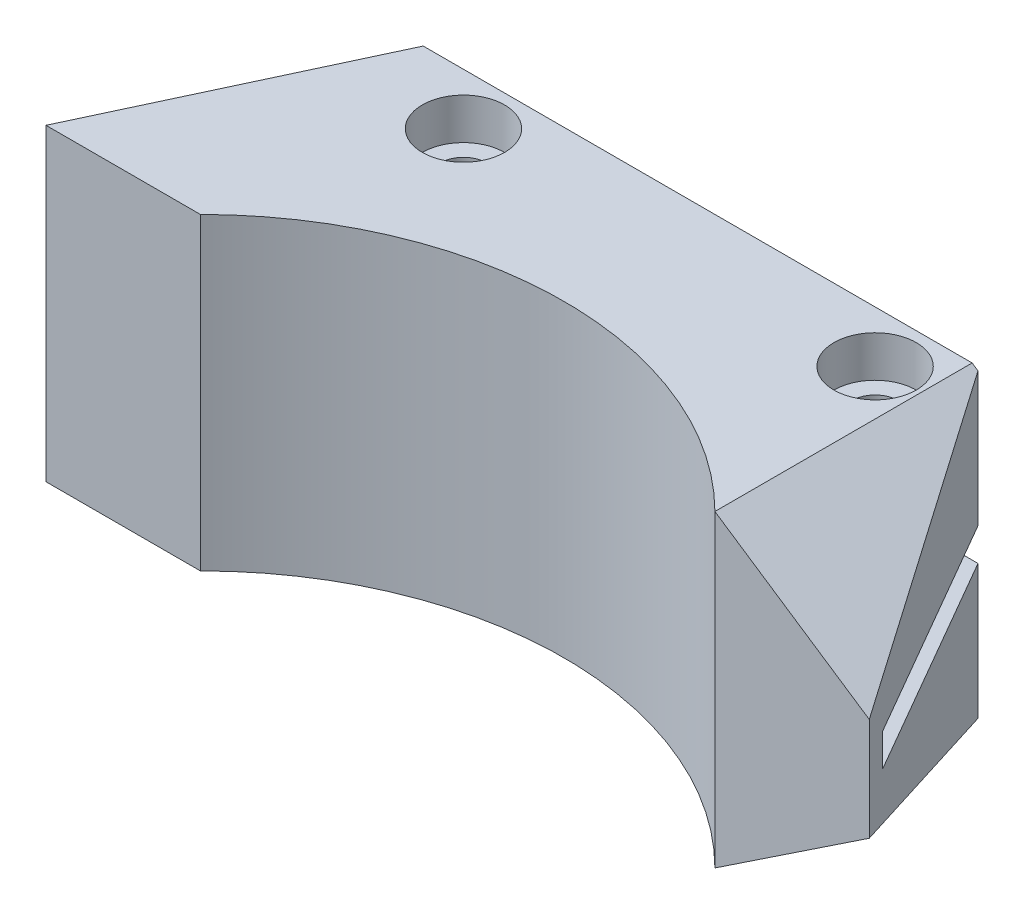
ISO-10303-21;
HEADER;
FILE_DESCRIPTION(('STEP AP214'),'2;1');
FILE_NAME('part.step','',(''),(''),'','','');
FILE_SCHEMA(('AUTOMOTIVE_DESIGN { 1 0 10303 214 1 1 1 1 }'));
ENDSEC;
DATA;
#1=APPLICATION_CONTEXT('core data for automotive mechanical design processes');
#2=APPLICATION_PROTOCOL_DEFINITION('international standard','automotive_design',2000,#1);
#3=PRODUCT_CONTEXT('',#1,'mechanical');
#4=PRODUCT('Part','Part','',(#3));
#5=PRODUCT_RELATED_PRODUCT_CATEGORY('part','',(#4));
#6=PRODUCT_DEFINITION_FORMATION('','',#4);
#7=PRODUCT_DEFINITION_CONTEXT('part definition',#1,'design');
#8=PRODUCT_DEFINITION('design','',#6,#7);
#9=PRODUCT_DEFINITION_SHAPE('','',#8);
#10=(LENGTH_UNIT() NAMED_UNIT(*) SI_UNIT(.MILLI.,.METRE.));
#11=(NAMED_UNIT(*) PLANE_ANGLE_UNIT() SI_UNIT($,.RADIAN.));
#12=(NAMED_UNIT(*) SI_UNIT($,.STERADIAN.) SOLID_ANGLE_UNIT());
#13=UNCERTAINTY_MEASURE_WITH_UNIT(LENGTH_MEASURE(1.E-05),#10,'distance_accuracy_value','');
#14=(GEOMETRIC_REPRESENTATION_CONTEXT(3) GLOBAL_UNCERTAINTY_ASSIGNED_CONTEXT((#13)) GLOBAL_UNIT_ASSIGNED_CONTEXT((#10,
#11,#12)) REPRESENTATION_CONTEXT('',''));
#15=CARTESIAN_POINT('',(0.,0.,0.));
#16=DIRECTION('',(0.,0.,1.));
#17=DIRECTION('',(1.,0.,0.));
#18=AXIS2_PLACEMENT_3D('',#15,#16,#17);
#19=CARTESIAN_POINT('',(-14.4337567297406,15.,-25.));
#20=DIRECTION('',(0.,0.,1.));
#21=DIRECTION('',(1.,0.,0.));
#22=AXIS2_PLACEMENT_3D('',#19,#20,#21);
#23=PLANE('',#22);
#24=DIRECTION('',(0.,-1.,0.));
#25=VECTOR('',#24,1.);
#26=CARTESIAN_POINT('',(-14.4337567297406,15.,-25.));
#27=LINE('',#26,#25);
#28=CARTESIAN_POINT('',(-14.4337567297406,-1.5875,-25.));
#29=VERTEX_POINT('',#28);
#30=CARTESIAN_POINT('',(-14.4337567297406,-14.6225044864937,-25.));
#31=VERTEX_POINT('',#30);
#32=EDGE_CURVE('E55',#29,#31,#27,.T.);
#33=ORIENTED_EDGE('',*,*,#32,.T.);
#34=DIRECTION('',(-0.832050294337844,-0.554700196225229,0.));
#35=VECTOR('',#34,1.);
#36=CARTESIAN_POINT('',(-15.,-15.,-25.));
#37=LINE('',#36,#35);
#38=CARTESIAN_POINT('',(-15.,-15.,-25.));
#39=VERTEX_POINT('',#38);
#40=EDGE_CURVE('E353',#31,#39,#37,.T.);
#41=ORIENTED_EDGE('',*,*,#40,.T.);
#42=DIRECTION('',(-1.,0.,0.));
#43=VECTOR('',#42,1.);
#44=CARTESIAN_POINT('',(-14.4337567297406,-15.,-25.));
#45=LINE('',#44,#43);
#46=CARTESIAN_POINT('',(-68.3423085461251,-15.,-25.));
#47=VERTEX_POINT('',#46);
#48=EDGE_CURVE('E221',#39,#47,#45,.T.);
#49=ORIENTED_EDGE('',*,*,#48,.T.);
#50=DIRECTION('',(0.,-1.,0.));
#51=VECTOR('',#50,1.);
#52=CARTESIAN_POINT('',(-68.3423085461251,15.,-25.));
#53=LINE('',#52,#51);
#54=CARTESIAN_POINT('',(-68.3423085461251,-1.5875,-25.));
#55=VERTEX_POINT('',#54);
#56=EDGE_CURVE('E195',#55,#47,#53,.T.);
#57=ORIENTED_EDGE('',*,*,#56,.F.);
#58=DIRECTION('',(-1.,0.,0.));
#59=VECTOR('',#58,1.);
#60=CARTESIAN_POINT('',(0.,-1.5875,-25.));
#61=LINE('',#60,#59);
#62=EDGE_CURVE('E70',#29,#55,#61,.T.);
#63=ORIENTED_EDGE('',*,*,#62,.F.);
#64=EDGE_LOOP('',(#33,#41,#49,#57,#63));
#65=FACE_BOUND('',#64,.T.);
#66=ADVANCED_FACE('F45',(#65),#23,.F.);
#67=CARTESIAN_POINT('',(0.,15.,0.));
#68=DIRECTION('',(-0.86602540378444,0.,0.499999999999998));
#69=DIRECTION('',(0.499999999999998,0.,0.86602540378444));
#70=AXIS2_PLACEMENT_3D('',#67,#68,#69);
#71=PLANE('',#70);
#72=CARTESIAN_POINT('',(-14.4337567297406,14.6225044864937,-25.));
#73=VERTEX_POINT('',#72);
#74=CARTESIAN_POINT('',(-14.4337567297406,1.5875,-25.));
#75=VERTEX_POINT('',#74);
#76=EDGE_CURVE('E11',#73,#75,#27,.T.);
#77=ORIENTED_EDGE('',*,*,#76,.F.);
#78=DIRECTION('',(0.474341649025255,-0.316227766016837,0.821583836257751));
#79=VECTOR('',#78,1.);
#80=CARTESIAN_POINT('',(-1.49999999999999,5.99999999999999,-2.59807621135331));
#81=LINE('',#80,#79);
#82=CARTESIAN_POINT('',(0.,5.,0.));
#83=VERTEX_POINT('',#82);
#84=EDGE_CURVE('E347',#73,#83,#81,.T.);
#85=ORIENTED_EDGE('',*,*,#84,.T.);
#86=DIRECTION('',(0.,-1.,0.));
#87=VECTOR('',#86,1.);
#88=CARTESIAN_POINT('',(0.,15.,0.));
#89=LINE('',#88,#87);
#90=CARTESIAN_POINT('',(0.,-5.,0.));
#91=VERTEX_POINT('',#90);
#92=EDGE_CURVE('E164',#83,#91,#89,.T.);
#93=ORIENTED_EDGE('',*,*,#92,.T.);
#94=DIRECTION('',(-0.474341649025255,-0.316227766016837,-0.821583836257751));
#95=VECTOR('',#94,1.);
#96=CARTESIAN_POINT('',(2.99999999999998,-3.00000000000002,5.19615242270662));
#97=LINE('',#96,#95);
#98=EDGE_CURVE('E154',#91,#31,#97,.T.);
#99=ORIENTED_EDGE('',*,*,#98,.T.);
#100=ORIENTED_EDGE('',*,*,#32,.F.);
#101=DIRECTION('',(-0.499999999999998,0.,-0.86602540378444));
#102=VECTOR('',#101,1.);
#103=CARTESIAN_POINT('',(0.,-1.5875,0.));
#104=LINE('',#103,#102);
#105=CARTESIAN_POINT('',(-1.73205080756888,-1.5875,-3.));
#106=VERTEX_POINT('',#105);
#107=EDGE_CURVE('E288',#106,#29,#104,.T.);
#108=ORIENTED_EDGE('',*,*,#107,.F.);
#109=DIRECTION('',(0.,-1.,0.));
#110=VECTOR('',#109,1.);
#111=CARTESIAN_POINT('',(-1.73205080756888,1.5875,-3.));
#112=LINE('',#111,#110);
#113=CARTESIAN_POINT('',(-1.73205080756888,1.5875,-3.));
#114=VERTEX_POINT('',#113);
#115=EDGE_CURVE('E245',#114,#106,#112,.T.);
#116=ORIENTED_EDGE('',*,*,#115,.F.);
#117=DIRECTION('',(-0.499999999999998,0.,-0.86602540378444));
#118=VECTOR('',#117,1.);
#119=CARTESIAN_POINT('',(0.,1.5875,0.));
#120=LINE('',#119,#118);
#121=EDGE_CURVE('E265',#114,#75,#120,.T.);
#122=ORIENTED_EDGE('',*,*,#121,.T.);
#123=EDGE_LOOP('',(#77,#85,#93,#99,#100,#108,#116,#122));
#124=FACE_BOUND('',#123,.T.);
#125=ADVANCED_FACE('F47',(#124),#71,.F.);
#126=DIRECTION('',(-1.,0.,0.));
#127=VECTOR('',#126,1.);
#128=CARTESIAN_POINT('',(-14.4337567297406,15.,-25.));
#129=LINE('',#128,#127);
#130=CARTESIAN_POINT('',(-15.,15.,-25.));
#131=VERTEX_POINT('',#130);
#132=CARTESIAN_POINT('',(-68.3423085461251,15.,-25.));
#133=VERTEX_POINT('',#132);
#134=EDGE_CURVE('E231',#131,#133,#129,.T.);
#135=ORIENTED_EDGE('',*,*,#134,.F.);
#136=DIRECTION('',(0.832050294337844,-0.554700196225229,0.));
#137=VECTOR('',#136,1.);
#138=CARTESIAN_POINT('',(0.,5.,-25.));
#139=LINE('',#138,#137);
#140=EDGE_CURVE('E62',#131,#73,#139,.T.);
#141=ORIENTED_EDGE('',*,*,#140,.T.);
#142=ORIENTED_EDGE('',*,*,#76,.T.);
#143=DIRECTION('',(-1.,0.,0.));
#144=VECTOR('',#143,1.);
#145=CARTESIAN_POINT('',(0.,1.5875,-25.));
#146=LINE('',#145,#144);
#147=CARTESIAN_POINT('',(-68.3423085461251,1.5875,-25.));
#148=VERTEX_POINT('',#147);
#149=EDGE_CURVE('E261',#75,#148,#146,.T.);
#150=ORIENTED_EDGE('',*,*,#149,.T.);
#151=EDGE_CURVE('E196',#133,#148,#53,.T.);
#152=ORIENTED_EDGE('',*,*,#151,.F.);
#153=EDGE_LOOP('',(#135,#141,#142,#150,#152));
#154=FACE_BOUND('',#153,.T.);
#155=ADVANCED_FACE('F365',(#154),#23,.F.);
#156=CARTESIAN_POINT('',(-68.3423085461251,15.,-25.));
#157=DIRECTION('',(0.906307787036651,0.,0.422618261740697));
#158=DIRECTION('',(0.422618261740697,0.,-0.906307787036651));
#159=AXIS2_PLACEMENT_3D('',#156,#157,#158);
#160=PLANE('',#159);
#161=ORIENTED_EDGE('',*,*,#151,.T.);
#162=DIRECTION('',(-0.422618261740697,0.,0.906307787036651));
#163=VECTOR('',#162,1.);
#164=CARTESIAN_POINT('',(-65.7115043874617,1.5875,-30.641777724759));
#165=LINE('',#164,#163);
#166=CARTESIAN_POINT('',(-73.0053851276751,1.5875,-15.));
#167=VERTEX_POINT('',#166);
#168=EDGE_CURVE('E258',#148,#167,#165,.T.);
#169=ORIENTED_EDGE('',*,*,#168,.T.);
#170=DIRECTION('',(0.,-1.,0.));
#171=VECTOR('',#170,1.);
#172=CARTESIAN_POINT('',(-73.0053851276751,1.5875,-15.));
#173=LINE('',#172,#171);
#174=CARTESIAN_POINT('',(-73.0053851276751,-1.5875,-15.));
#175=VERTEX_POINT('',#174);
#176=EDGE_CURVE('E248',#167,#175,#173,.T.);
#177=ORIENTED_EDGE('',*,*,#176,.T.);
#178=DIRECTION('',(-0.422618261740697,0.,0.906307787036651));
#179=VECTOR('',#178,1.);
#180=CARTESIAN_POINT('',(-65.7115043874617,-1.5875,-30.641777724759));
#181=LINE('',#180,#179);
#182=EDGE_CURVE('E213',#55,#175,#181,.T.);
#183=ORIENTED_EDGE('',*,*,#182,.F.);
#184=ORIENTED_EDGE('',*,*,#56,.T.);
#185=DIRECTION('',(-0.422618261740697,0.,0.906307787036651));
#186=VECTOR('',#185,1.);
#187=CARTESIAN_POINT('',(-68.3423085461251,-15.,-25.));
#188=LINE('',#187,#186);
#189=CARTESIAN_POINT('',(-80.,-15.,0.));
#190=VERTEX_POINT('',#189);
#191=EDGE_CURVE('E211',#47,#190,#188,.T.);
#192=ORIENTED_EDGE('',*,*,#191,.T.);
#193=DIRECTION('',(0.,-1.,0.));
#194=VECTOR('',#193,1.);
#195=CARTESIAN_POINT('',(-80.,15.,0.));
#196=LINE('',#195,#194);
#197=CARTESIAN_POINT('',(-80.,15.,0.));
#198=VERTEX_POINT('',#197);
#199=EDGE_CURVE('E187',#198,#190,#196,.T.);
#200=ORIENTED_EDGE('',*,*,#199,.F.);
#201=DIRECTION('',(-0.422618261740697,0.,0.906307787036651));
#202=VECTOR('',#201,1.);
#203=CARTESIAN_POINT('',(-68.3423085461251,15.,-25.));
#204=LINE('',#203,#202);
#205=EDGE_CURVE('E233',#133,#198,#204,.T.);
#206=ORIENTED_EDGE('',*,*,#205,.F.);
#207=EDGE_LOOP('',(#161,#169,#177,#183,#184,#192,#200,#206));
#208=FACE_BOUND('',#207,.T.);
#209=ADVANCED_FACE('F209',(#208),#160,.F.);
#210=CARTESIAN_POINT('',(-80.,15.,0.));
#211=DIRECTION('',(0.,0.,-1.));
#212=DIRECTION('',(-1.,0.,0.));
#213=AXIS2_PLACEMENT_3D('',#210,#211,#212);
#214=PLANE('',#213);
#215=DIRECTION('',(1.,0.,0.));
#216=VECTOR('',#215,1.);
#217=CARTESIAN_POINT('',(-80.,-15.,0.));
#218=LINE('',#217,#216);
#219=CARTESIAN_POINT('',(-65.,-15.,0.));
#220=VERTEX_POINT('',#219);
#221=EDGE_CURVE('E222',#190,#220,#218,.T.);
#222=ORIENTED_EDGE('',*,*,#221,.T.);
#223=DIRECTION('',(0.,-1.,0.));
#224=VECTOR('',#223,1.);
#225=CARTESIAN_POINT('',(-65.,15.,0.));
#226=LINE('',#225,#224);
#227=CARTESIAN_POINT('',(-65.,15.,0.));
#228=VERTEX_POINT('',#227);
#229=EDGE_CURVE('E183',#228,#220,#226,.T.);
#230=ORIENTED_EDGE('',*,*,#229,.F.);
#231=DIRECTION('',(1.,0.,0.));
#232=VECTOR('',#231,1.);
#233=CARTESIAN_POINT('',(-80.,15.,0.));
#234=LINE('',#233,#232);
#235=EDGE_CURVE('E172',#198,#228,#234,.T.);
#236=ORIENTED_EDGE('',*,*,#235,.F.);
#237=ORIENTED_EDGE('',*,*,#199,.T.);
#238=EDGE_LOOP('',(#222,#230,#236,#237));
#239=FACE_BOUND('',#238,.T.);
#240=ADVANCED_FACE('F387',(#239),#214,.F.);
#241=CARTESIAN_POINT('',(-40.,15.,24.9999999999999));
#242=DIRECTION('',(0.,-1.,0.));
#243=DIRECTION('',(0.,0.,-1.));
#244=AXIS2_PLACEMENT_3D('',#241,#242,#243);
#245=CYLINDRICAL_SURFACE('',#244,35.3553390593273);
#246=CARTESIAN_POINT('',(-40.,-15.,24.9999999999999));
#247=DIRECTION('',(0.,-1.,0.));
#248=DIRECTION('',(0.,0.,-1.));
#249=AXIS2_PLACEMENT_3D('',#246,#247,#248);
#250=CIRCLE('',#249,35.3553390593273);
#251=CARTESIAN_POINT('',(-15.,-15.,0.));
#252=VERTEX_POINT('',#251);
#253=EDGE_CURVE('E181',#220,#252,#250,.T.);
#254=ORIENTED_EDGE('',*,*,#253,.T.);
#255=DIRECTION('',(0.,-1.,0.));
#256=VECTOR('',#255,1.);
#257=CARTESIAN_POINT('',(-15.,15.,0.));
#258=LINE('',#257,#256);
#259=CARTESIAN_POINT('',(-15.,15.,0.));
#260=VERTEX_POINT('',#259);
#261=EDGE_CURVE('E162',#260,#252,#258,.T.);
#262=ORIENTED_EDGE('',*,*,#261,.F.);
#263=CARTESIAN_POINT('',(-40.,15.,24.9999999999999));
#264=DIRECTION('',(0.,-1.,0.));
#265=DIRECTION('',(0.,0.,-1.));
#266=AXIS2_PLACEMENT_3D('',#263,#264,#265);
#267=CIRCLE('',#266,35.3553390593273);
#268=EDGE_CURVE('E169',#228,#260,#267,.T.);
#269=ORIENTED_EDGE('',*,*,#268,.F.);
#270=ORIENTED_EDGE('',*,*,#229,.T.);
#271=EDGE_LOOP('',(#254,#262,#269,#270));
#272=FACE_BOUND('',#271,.T.);
#273=ADVANCED_FACE('F179',(#272),#245,.F.);
#274=CARTESIAN_POINT('',(0.,15.,0.));
#275=DIRECTION('',(0.,0.,-1.));
#276=DIRECTION('',(-1.,0.,0.));
#277=AXIS2_PLACEMENT_3D('',#274,#275,#276);
#278=PLANE('',#277);
#279=ORIENTED_EDGE('',*,*,#92,.F.);
#280=DIRECTION('',(0.832050294337844,-0.554700196225229,0.));
#281=VECTOR('',#280,1.);
#282=CARTESIAN_POINT('',(0.,5.,0.));
#283=LINE('',#282,#281);
#284=EDGE_CURVE('E148',#260,#83,#283,.T.);
#285=ORIENTED_EDGE('',*,*,#284,.F.);
#286=ORIENTED_EDGE('',*,*,#261,.T.);
#287=DIRECTION('',(-0.832050294337844,-0.554700196225229,0.));
#288=VECTOR('',#287,1.);
#289=CARTESIAN_POINT('',(-15.,-15.,0.));
#290=LINE('',#289,#288);
#291=EDGE_CURVE('E166',#91,#252,#290,.T.);
#292=ORIENTED_EDGE('',*,*,#291,.F.);
#293=EDGE_LOOP('',(#279,#285,#286,#292));
#294=FACE_BOUND('',#293,.T.);
#295=ADVANCED_FACE('F159',(#294),#278,.F.);
#296=CARTESIAN_POINT('',(-40.,15.,24.9999999999999));
#297=DIRECTION('',(0.,-1.,0.));
#298=DIRECTION('',(0.,0.,-1.));
#299=AXIS2_PLACEMENT_3D('',#296,#297,#298);
#300=PLANE('',#299);
#301=CARTESIAN_POINT('',(-59.4337567297406,15.,-20.));
#302=DIRECTION('',(0.,1.,0.));
#303=DIRECTION('',(0.,0.,1.));
#304=AXIS2_PLACEMENT_3D('',#301,#302,#303);
#305=CIRCLE('',#304,4.);
#306=CARTESIAN_POINT('',(-59.4337567297406,15.,-16.));
#307=VERTEX_POINT('',#306);
#308=EDGE_CURVE('E343',#307,#307,#305,.T.);
#309=ORIENTED_EDGE('',*,*,#308,.F.);
#310=EDGE_LOOP('',(#309));
#311=FACE_BOUND('',#310,.T.);
#312=CARTESIAN_POINT('',(-19.4337567297406,15.,-20.));
#313=DIRECTION('',(0.,1.,0.));
#314=DIRECTION('',(0.,0.,1.));
#315=AXIS2_PLACEMENT_3D('',#312,#313,#314);
#316=CIRCLE('',#315,4.);
#317=CARTESIAN_POINT('',(-19.4337567297406,15.,-16.));
#318=VERTEX_POINT('',#317);
#319=EDGE_CURVE('E319',#318,#318,#316,.T.);
#320=ORIENTED_EDGE('',*,*,#319,.F.);
#321=EDGE_LOOP('',(#320));
#322=FACE_BOUND('',#321,.T.);
#323=ORIENTED_EDGE('',*,*,#268,.T.);
#324=DIRECTION('',(0.,0.,1.));
#325=VECTOR('',#324,1.);
#326=CARTESIAN_POINT('',(-15.,15.,-25.));
#327=LINE('',#326,#325);
#328=EDGE_CURVE('E145',#131,#260,#327,.T.);
#329=ORIENTED_EDGE('',*,*,#328,.F.);
#330=ORIENTED_EDGE('',*,*,#134,.T.);
#331=ORIENTED_EDGE('',*,*,#205,.T.);
#332=ORIENTED_EDGE('',*,*,#235,.T.);
#333=EDGE_LOOP('',(#323,#329,#330,#331,#332));
#334=FACE_BOUND('',#333,.T.);
#335=ADVANCED_FACE('F170',(#311,#322,#334),#300,.F.);
#336=CARTESIAN_POINT('',(-40.,-15.,24.9999999999999));
#337=DIRECTION('',(0.,-1.,0.));
#338=DIRECTION('',(0.,0.,-1.));
#339=AXIS2_PLACEMENT_3D('',#336,#337,#338);
#340=PLANE('',#339);
#341=DIRECTION('',(0.,0.,1.));
#342=VECTOR('',#341,1.);
#343=CARTESIAN_POINT('',(-15.,-15.,-25.));
#344=LINE('',#343,#342);
#345=EDGE_CURVE('E357',#39,#252,#344,.T.);
#346=ORIENTED_EDGE('',*,*,#345,.T.);
#347=ORIENTED_EDGE('',*,*,#253,.F.);
#348=ORIENTED_EDGE('',*,*,#221,.F.);
#349=ORIENTED_EDGE('',*,*,#191,.F.);
#350=ORIENTED_EDGE('',*,*,#48,.F.);
#351=EDGE_LOOP('',(#346,#347,#348,#349,#350));
#352=FACE_BOUND('',#351,.T.);
#353=CARTESIAN_POINT('',(-59.4337567297406,-15.,-20.));
#354=DIRECTION('',(0.,1.,0.));
#355=DIRECTION('',(0.,0.,1.));
#356=AXIS2_PLACEMENT_3D('',#353,#354,#355);
#357=CIRCLE('',#356,2.24999999999999);
#358=CARTESIAN_POINT('',(-59.4337567297406,-15.,-17.75));
#359=VERTEX_POINT('',#358);
#360=EDGE_CURVE('E331',#359,#359,#357,.T.);
#361=ORIENTED_EDGE('',*,*,#360,.T.);
#362=EDGE_LOOP('',(#361));
#363=FACE_BOUND('',#362,.T.);
#364=CARTESIAN_POINT('',(-19.4337567297406,-15.,-20.));
#365=DIRECTION('',(0.,1.,0.));
#366=DIRECTION('',(0.,0.,1.));
#367=AXIS2_PLACEMENT_3D('',#364,#365,#366);
#368=CIRCLE('',#367,2.24999999999999);
#369=CARTESIAN_POINT('',(-19.4337567297406,-15.,-17.75));
#370=VERTEX_POINT('',#369);
#371=EDGE_CURVE('E307',#370,#370,#368,.T.);
#372=ORIENTED_EDGE('',*,*,#371,.T.);
#373=EDGE_LOOP('',(#372));
#374=FACE_BOUND('',#373,.T.);
#375=ADVANCED_FACE('F219',(#352,#363,#374),#340,.T.);
#376=CARTESIAN_POINT('',(-22.040346526314,1.5875,-11.825));
#377=DIRECTION('',(0.,-1.,0.));
#378=DIRECTION('',(0.,0.,-1.));
#379=AXIS2_PLACEMENT_3D('',#376,#377,#378);
#380=CYLINDRICAL_SURFACE('',#379,3.175);
#381=DIRECTION('',(0.,-1.,0.));
#382=VECTOR('',#381,1.);
#383=CARTESIAN_POINT('',(-22.040346526314,1.5875,-15.));
#384=LINE('',#383,#382);
#385=CARTESIAN_POINT('',(-22.040346526314,1.5875,-15.));
#386=VERTEX_POINT('',#385);
#387=CARTESIAN_POINT('',(-22.040346526314,-1.5875,-15.));
#388=VERTEX_POINT('',#387);
#389=EDGE_CURVE('E251',#386,#388,#384,.T.);
#390=ORIENTED_EDGE('',*,*,#389,.F.);
#391=CARTESIAN_POINT('',(-22.040346526314,1.5875,-11.825));
#392=DIRECTION('',(0.,1.,0.));
#393=DIRECTION('',(0.,0.,1.));
#394=AXIS2_PLACEMENT_3D('',#391,#392,#393);
#395=CIRCLE('',#394,3.175);
#396=CARTESIAN_POINT('',(-19.2907158692984,1.5875,-13.4125));
#397=VERTEX_POINT('',#396);
#398=EDGE_CURVE('E277',#397,#386,#395,.T.);
#399=ORIENTED_EDGE('',*,*,#398,.F.);
#400=DIRECTION('',(0.,-1.,0.));
#401=VECTOR('',#400,1.);
#402=CARTESIAN_POINT('',(-19.2907158692984,1.5875,-13.4125));
#403=LINE('',#402,#401);
#404=CARTESIAN_POINT('',(-19.2907158692984,-1.5875,-13.4125));
#405=VERTEX_POINT('',#404);
#406=EDGE_CURVE('E228',#397,#405,#403,.T.);
#407=ORIENTED_EDGE('',*,*,#406,.T.);
#408=CARTESIAN_POINT('',(-22.040346526314,-1.5875,-11.825));
#409=DIRECTION('',(0.,1.,0.));
#410=DIRECTION('',(0.,0.,1.));
#411=AXIS2_PLACEMENT_3D('',#408,#409,#410);
#412=CIRCLE('',#411,3.175);
#413=EDGE_CURVE('E299',#405,#388,#412,.T.);
#414=ORIENTED_EDGE('',*,*,#413,.T.);
#415=EDGE_LOOP('',(#390,#399,#407,#414));
#416=FACE_BOUND('',#415,.T.);
#417=ADVANCED_FACE('F393',(#416),#380,.T.);
#418=CARTESIAN_POINT('',(-8.66025403784439,1.5875,5.));
#419=DIRECTION('',(-0.866025403784439,0.,0.5));
#420=DIRECTION('',(0.5,0.,0.866025403784439));
#421=AXIS2_PLACEMENT_3D('',#418,#419,#420);
#422=PLANE('',#421);
#423=ORIENTED_EDGE('',*,*,#406,.F.);
#424=DIRECTION('',(-0.5,0.,-0.866025403784439));
#425=VECTOR('',#424,1.);
#426=CARTESIAN_POINT('',(-8.66025403784439,1.5875,5.));
#427=LINE('',#426,#425);
#428=CARTESIAN_POINT('',(-13.2790561913614,1.5875,-3.));
#429=VERTEX_POINT('',#428);
#430=EDGE_CURVE('E273',#429,#397,#427,.T.);
#431=ORIENTED_EDGE('',*,*,#430,.F.);
#432=DIRECTION('',(0.,-1.,0.));
#433=VECTOR('',#432,1.);
#434=CARTESIAN_POINT('',(-13.2790561913614,1.5875,-3.));
#435=LINE('',#434,#433);
#436=CARTESIAN_POINT('',(-13.2790561913614,-1.5875,-3.));
#437=VERTEX_POINT('',#436);
#438=EDGE_CURVE('E242',#429,#437,#435,.T.);
#439=ORIENTED_EDGE('',*,*,#438,.T.);
#440=DIRECTION('',(-0.5,0.,-0.866025403784439));
#441=VECTOR('',#440,1.);
#442=CARTESIAN_POINT('',(-8.66025403784439,-1.5875,5.));
#443=LINE('',#442,#441);
#444=EDGE_CURVE('E295',#437,#405,#443,.T.);
#445=ORIENTED_EDGE('',*,*,#444,.T.);
#446=EDGE_LOOP('',(#423,#431,#439,#445));
#447=FACE_BOUND('',#446,.T.);
#448=ADVANCED_FACE('F379',(#447),#422,.F.);
#449=CARTESIAN_POINT('',(0.,1.5875,-3.));
#450=DIRECTION('',(0.,0.,1.));
#451=DIRECTION('',(1.,0.,0.));
#452=AXIS2_PLACEMENT_3D('',#449,#450,#451);
#453=PLANE('',#452);
#454=ORIENTED_EDGE('',*,*,#438,.F.);
#455=DIRECTION('',(-1.,0.,0.));
#456=VECTOR('',#455,1.);
#457=CARTESIAN_POINT('',(0.,1.5875,-3.));
#458=LINE('',#457,#456);
#459=EDGE_CURVE('E269',#114,#429,#458,.T.);
#460=ORIENTED_EDGE('',*,*,#459,.F.);
#461=ORIENTED_EDGE('',*,*,#115,.T.);
#462=DIRECTION('',(-1.,0.,0.));
#463=VECTOR('',#462,1.);
#464=CARTESIAN_POINT('',(0.,-1.5875,-3.));
#465=LINE('',#464,#463);
#466=EDGE_CURVE('E291',#106,#437,#465,.T.);
#467=ORIENTED_EDGE('',*,*,#466,.T.);
#468=EDGE_LOOP('',(#454,#460,#461,#467));
#469=FACE_BOUND('',#468,.T.);
#470=ADVANCED_FACE('F374',(#469),#453,.F.);
#471=CARTESIAN_POINT('',(0.,1.5875,-15.));
#472=DIRECTION('',(0.,0.,1.));
#473=DIRECTION('',(1.,0.,0.));
#474=AXIS2_PLACEMENT_3D('',#471,#472,#473);
#475=PLANE('',#474);
#476=ORIENTED_EDGE('',*,*,#176,.F.);
#477=DIRECTION('',(-1.,0.,0.));
#478=VECTOR('',#477,1.);
#479=CARTESIAN_POINT('',(0.,1.5875,-15.));
#480=LINE('',#479,#478);
#481=EDGE_CURVE('E254',#386,#167,#480,.T.);
#482=ORIENTED_EDGE('',*,*,#481,.F.);
#483=ORIENTED_EDGE('',*,*,#389,.T.);
#484=DIRECTION('',(-1.,0.,0.));
#485=VECTOR('',#484,1.);
#486=CARTESIAN_POINT('',(0.,-1.5875,-15.));
#487=LINE('',#486,#485);
#488=EDGE_CURVE('E281',#388,#175,#487,.T.);
#489=ORIENTED_EDGE('',*,*,#488,.T.);
#490=EDGE_LOOP('',(#476,#482,#483,#489));
#491=FACE_BOUND('',#490,.T.);
#492=ADVANCED_FACE('F384',(#491),#475,.F.);
#493=CARTESIAN_POINT('',(0.,1.5875,0.));
#494=DIRECTION('',(0.,1.,0.));
#495=DIRECTION('',(0.,0.,1.));
#496=AXIS2_PLACEMENT_3D('',#493,#494,#495);
#497=PLANE('',#496);
#498=CARTESIAN_POINT('',(-59.4337567297406,1.5875,-20.));
#499=DIRECTION('',(0.,1.,0.));
#500=DIRECTION('',(0.,0.,1.));
#501=AXIS2_PLACEMENT_3D('',#498,#499,#500);
#502=CIRCLE('',#501,2.25);
#503=CARTESIAN_POINT('',(-59.4337567297406,1.5875,-17.75));
#504=VERTEX_POINT('',#503);
#505=EDGE_CURVE('E327',#504,#504,#502,.T.);
#506=ORIENTED_EDGE('',*,*,#505,.T.);
#507=EDGE_LOOP('',(#506));
#508=FACE_BOUND('',#507,.T.);
#509=CARTESIAN_POINT('',(-19.4337567297406,1.5875,-20.));
#510=DIRECTION('',(0.,1.,0.));
#511=DIRECTION('',(0.,0.,1.));
#512=AXIS2_PLACEMENT_3D('',#509,#510,#511);
#513=CIRCLE('',#512,2.25);
#514=CARTESIAN_POINT('',(-19.4337567297406,1.5875,-17.75));
#515=VERTEX_POINT('',#514);
#516=EDGE_CURVE('E49',#515,#515,#513,.T.);
#517=ORIENTED_EDGE('',*,*,#516,.T.);
#518=EDGE_LOOP('',(#517));
#519=FACE_BOUND('',#518,.T.);
#520=ORIENTED_EDGE('',*,*,#398,.T.);
#521=ORIENTED_EDGE('',*,*,#481,.T.);
#522=ORIENTED_EDGE('',*,*,#168,.F.);
#523=ORIENTED_EDGE('',*,*,#149,.F.);
#524=ORIENTED_EDGE('',*,*,#121,.F.);
#525=ORIENTED_EDGE('',*,*,#459,.T.);
#526=ORIENTED_EDGE('',*,*,#430,.T.);
#527=EDGE_LOOP('',(#520,#521,#522,#523,#524,#525,#526));
#528=FACE_BOUND('',#527,.T.);
#529=ADVANCED_FACE('F372',(#508,#519,#528),#497,.F.);
#530=CARTESIAN_POINT('',(0.,-1.5875,0.));
#531=DIRECTION('',(0.,1.,0.));
#532=DIRECTION('',(0.,0.,1.));
#533=AXIS2_PLACEMENT_3D('',#530,#531,#532);
#534=PLANE('',#533);
#535=CARTESIAN_POINT('',(-59.4337567297406,-1.5875,-20.));
#536=DIRECTION('',(0.,1.,0.));
#537=DIRECTION('',(0.,0.,1.));
#538=AXIS2_PLACEMENT_3D('',#535,#536,#537);
#539=CIRCLE('',#538,2.25);
#540=CARTESIAN_POINT('',(-59.4337567297406,-1.5875,-17.75));
#541=VERTEX_POINT('',#540);
#542=EDGE_CURVE('E323',#541,#541,#539,.T.);
#543=ORIENTED_EDGE('',*,*,#542,.F.);
#544=EDGE_LOOP('',(#543));
#545=FACE_BOUND('',#544,.T.);
#546=CARTESIAN_POINT('',(-19.4337567297406,-1.5875,-20.));
#547=DIRECTION('',(0.,1.,0.));
#548=DIRECTION('',(0.,0.,1.));
#549=AXIS2_PLACEMENT_3D('',#546,#547,#548);
#550=CIRCLE('',#549,2.25);
#551=CARTESIAN_POINT('',(-19.4337567297406,-1.5875,-17.75));
#552=VERTEX_POINT('',#551);
#553=EDGE_CURVE('E303',#552,#552,#550,.T.);
#554=ORIENTED_EDGE('',*,*,#553,.F.);
#555=EDGE_LOOP('',(#554));
#556=FACE_BOUND('',#555,.T.);
#557=ORIENTED_EDGE('',*,*,#413,.F.);
#558=ORIENTED_EDGE('',*,*,#444,.F.);
#559=ORIENTED_EDGE('',*,*,#466,.F.);
#560=ORIENTED_EDGE('',*,*,#107,.T.);
#561=ORIENTED_EDGE('',*,*,#62,.T.);
#562=ORIENTED_EDGE('',*,*,#182,.T.);
#563=ORIENTED_EDGE('',*,*,#488,.F.);
#564=EDGE_LOOP('',(#557,#558,#559,#560,#561,#562,#563));
#565=FACE_BOUND('',#564,.T.);
#566=ADVANCED_FACE('F392',(#545,#556,#565),#534,.T.);
#567=CARTESIAN_POINT('',(-19.4337567297406,15.,-20.));
#568=DIRECTION('',(0.,1.,0.));
#569=DIRECTION('',(0.,0.,1.));
#570=AXIS2_PLACEMENT_3D('',#567,#568,#569);
#571=CYLINDRICAL_SURFACE('',#570,4.);
#572=CARTESIAN_POINT('',(-19.4337567297406,11.,-20.));
#573=DIRECTION('',(0.,1.,0.));
#574=DIRECTION('',(0.,0.,1.));
#575=AXIS2_PLACEMENT_3D('',#572,#573,#574);
#576=CIRCLE('',#575,4.);
#577=CARTESIAN_POINT('',(-19.4337567297406,11.,-16.));
#578=VERTEX_POINT('',#577);
#579=EDGE_CURVE('E315',#578,#578,#576,.T.);
#580=ORIENTED_EDGE('',*,*,#579,.F.);
#581=EDGE_LOOP('',(#580));
#582=FACE_BOUND('',#581,.T.);
#583=ORIENTED_EDGE('',*,*,#319,.T.);
#584=EDGE_LOOP('',(#583));
#585=FACE_BOUND('',#584,.T.);
#586=ADVANCED_FACE('F429',(#582,#585),#571,.F.);
#587=CARTESIAN_POINT('',(-17.1837567297406,11.,-20.));
#588=DIRECTION('',(0.,-1.,0.));
#589=DIRECTION('',(0.,0.,-1.));
#590=AXIS2_PLACEMENT_3D('',#587,#588,#589);
#591=PLANE('',#590);
#592=CARTESIAN_POINT('',(-19.4337567297406,11.,-20.));
#593=DIRECTION('',(0.,1.,0.));
#594=DIRECTION('',(0.,0.,1.));
#595=AXIS2_PLACEMENT_3D('',#592,#593,#594);
#596=CIRCLE('',#595,2.25);
#597=CARTESIAN_POINT('',(-19.4337567297406,11.,-17.75));
#598=VERTEX_POINT('',#597);
#599=EDGE_CURVE('E311',#598,#598,#596,.T.);
#600=ORIENTED_EDGE('',*,*,#599,.F.);
#601=EDGE_LOOP('',(#600));
#602=FACE_BOUND('',#601,.T.);
#603=ORIENTED_EDGE('',*,*,#579,.T.);
#604=EDGE_LOOP('',(#603));
#605=FACE_BOUND('',#604,.T.);
#606=ADVANCED_FACE('F431',(#602,#605),#591,.F.);
#607=CARTESIAN_POINT('',(-19.4337567297406,15.,-20.));
#608=DIRECTION('',(0.,1.,0.));
#609=DIRECTION('',(0.,0.,1.));
#610=AXIS2_PLACEMENT_3D('',#607,#608,#609);
#611=CYLINDRICAL_SURFACE('',#610,2.25);
#612=ORIENTED_EDGE('',*,*,#599,.T.);
#613=EDGE_LOOP('',(#612));
#614=FACE_BOUND('',#613,.T.);
#615=ORIENTED_EDGE('',*,*,#516,.F.);
#616=EDGE_LOOP('',(#615));
#617=FACE_BOUND('',#616,.T.);
#618=ADVANCED_FACE('F438',(#614,#617),#611,.F.);
#619=ORIENTED_EDGE('',*,*,#553,.T.);
#620=EDGE_LOOP('',(#619));
#621=FACE_BOUND('',#620,.T.);
#622=ORIENTED_EDGE('',*,*,#371,.F.);
#623=EDGE_LOOP('',(#622));
#624=FACE_BOUND('',#623,.T.);
#625=ADVANCED_FACE('F448',(#621,#624),#611,.F.);
#626=CARTESIAN_POINT('',(-59.4337567297406,15.,-20.));
#627=DIRECTION('',(0.,1.,0.));
#628=DIRECTION('',(0.,0.,1.));
#629=AXIS2_PLACEMENT_3D('',#626,#627,#628);
#630=CYLINDRICAL_SURFACE('',#629,2.25);
#631=ORIENTED_EDGE('',*,*,#542,.T.);
#632=EDGE_LOOP('',(#631));
#633=FACE_BOUND('',#632,.T.);
#634=ORIENTED_EDGE('',*,*,#360,.F.);
#635=EDGE_LOOP('',(#634));
#636=FACE_BOUND('',#635,.T.);
#637=ADVANCED_FACE('F445',(#633,#636),#630,.F.);
#638=CARTESIAN_POINT('',(-59.4337567297406,11.,-20.));
#639=DIRECTION('',(0.,1.,0.));
#640=DIRECTION('',(0.,0.,1.));
#641=AXIS2_PLACEMENT_3D('',#638,#639,#640);
#642=CIRCLE('',#641,2.25);
#643=CARTESIAN_POINT('',(-59.4337567297406,11.,-17.75));
#644=VERTEX_POINT('',#643);
#645=EDGE_CURVE('E335',#644,#644,#642,.T.);
#646=ORIENTED_EDGE('',*,*,#645,.T.);
#647=EDGE_LOOP('',(#646));
#648=FACE_BOUND('',#647,.T.);
#649=ORIENTED_EDGE('',*,*,#505,.F.);
#650=EDGE_LOOP('',(#649));
#651=FACE_BOUND('',#650,.T.);
#652=ADVANCED_FACE('F511',(#648,#651),#630,.F.);
#653=CARTESIAN_POINT('',(-57.1837567297406,11.,-20.));
#654=DIRECTION('',(0.,-1.,0.));
#655=DIRECTION('',(0.,0.,-1.));
#656=AXIS2_PLACEMENT_3D('',#653,#654,#655);
#657=PLANE('',#656);
#658=ORIENTED_EDGE('',*,*,#645,.F.);
#659=EDGE_LOOP('',(#658));
#660=FACE_BOUND('',#659,.T.);
#661=CARTESIAN_POINT('',(-59.4337567297406,11.,-20.));
#662=DIRECTION('',(0.,1.,0.));
#663=DIRECTION('',(0.,0.,1.));
#664=AXIS2_PLACEMENT_3D('',#661,#662,#663);
#665=CIRCLE('',#664,4.);
#666=CARTESIAN_POINT('',(-59.4337567297406,11.,-16.));
#667=VERTEX_POINT('',#666);
#668=EDGE_CURVE('E339',#667,#667,#665,.T.);
#669=ORIENTED_EDGE('',*,*,#668,.T.);
#670=EDGE_LOOP('',(#669));
#671=FACE_BOUND('',#670,.T.);
#672=ADVANCED_FACE('F520',(#660,#671),#657,.F.);
#673=CARTESIAN_POINT('',(-59.4337567297406,15.,-20.));
#674=DIRECTION('',(0.,1.,0.));
#675=DIRECTION('',(0.,0.,1.));
#676=AXIS2_PLACEMENT_3D('',#673,#674,#675);
#677=CYLINDRICAL_SURFACE('',#676,4.);
#678=ORIENTED_EDGE('',*,*,#668,.F.);
#679=EDGE_LOOP('',(#678));
#680=FACE_BOUND('',#679,.T.);
#681=ORIENTED_EDGE('',*,*,#308,.T.);
#682=EDGE_LOOP('',(#681));
#683=FACE_BOUND('',#682,.T.);
#684=ADVANCED_FACE('F529',(#680,#683),#677,.F.);
#685=CARTESIAN_POINT('',(-15.,-15.,-25.));
#686=DIRECTION('',(-0.554700196225229,0.832050294337844,0.));
#687=DIRECTION('',(-0.832050294337844,-0.554700196225229,0.));
#688=AXIS2_PLACEMENT_3D('',#685,#686,#687);
#689=PLANE('',#688);
#690=ORIENTED_EDGE('',*,*,#291,.T.);
#691=ORIENTED_EDGE('',*,*,#345,.F.);
#692=ORIENTED_EDGE('',*,*,#40,.F.);
#693=ORIENTED_EDGE('',*,*,#98,.F.);
#694=EDGE_LOOP('',(#690,#691,#692,#693));
#695=FACE_BOUND('',#694,.T.);
#696=ADVANCED_FACE('F389',(#695),#689,.F.);
#697=CARTESIAN_POINT('',(0.,5.,-25.));
#698=DIRECTION('',(-0.554700196225229,-0.832050294337844,0.));
#699=DIRECTION('',(0.832050294337844,-0.554700196225229,0.));
#700=AXIS2_PLACEMENT_3D('',#697,#698,#699);
#701=PLANE('',#700);
#702=ORIENTED_EDGE('',*,*,#140,.F.);
#703=ORIENTED_EDGE('',*,*,#328,.T.);
#704=ORIENTED_EDGE('',*,*,#284,.T.);
#705=ORIENTED_EDGE('',*,*,#84,.F.);
#706=EDGE_LOOP('',(#702,#703,#704,#705));
#707=FACE_BOUND('',#706,.T.);
#708=ADVANCED_FACE('F147',(#707),#701,.F.);
#709=CLOSED_SHELL('',(#66,#125,#155,#209,#240,#273,#295,#335,#375,#417,#448,#470,#492,#529,#566,
#586,#606,#618,#625,#637,#652,#672,#684,#696,#708));
#710=MANIFOLD_SOLID_BREP('B2',#709);
#711=ADVANCED_BREP_SHAPE_REPRESENTATION('',(#18,#710),#14);
#712=SHAPE_DEFINITION_REPRESENTATION(#9,#711);
ENDSEC;
END-ISO-10303-21;
